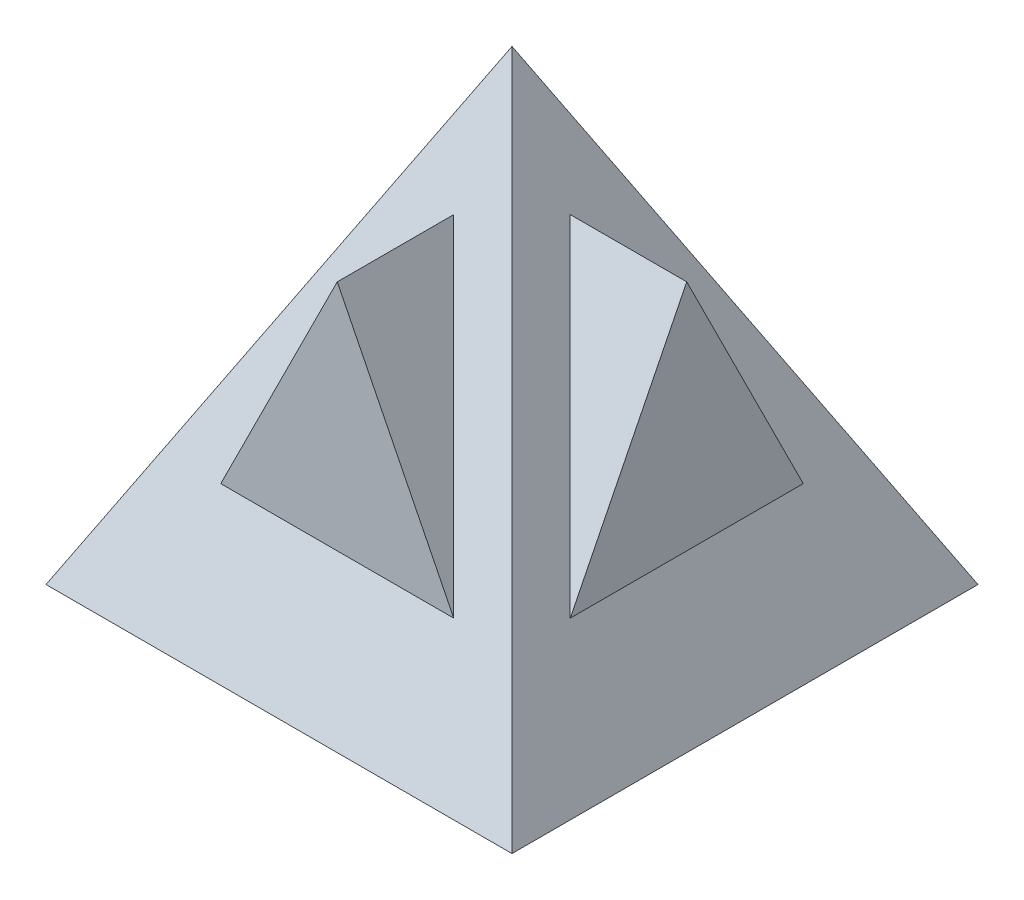
ISO-10303-21;
HEADER;
FILE_DESCRIPTION(('STEP AP214'),'2;1');
FILE_NAME('part.step','',(''),(''),'','','');
FILE_SCHEMA(('AUTOMOTIVE_DESIGN { 1 0 10303 214 1 1 1 1 }'));
ENDSEC;
DATA;
#1=APPLICATION_CONTEXT('core data for automotive mechanical design processes');
#2=APPLICATION_PROTOCOL_DEFINITION('international standard','automotive_design',2000,#1);
#3=PRODUCT_CONTEXT('',#1,'mechanical');
#4=PRODUCT('Part','Part','',(#3));
#5=PRODUCT_RELATED_PRODUCT_CATEGORY('part','',(#4));
#6=PRODUCT_DEFINITION_FORMATION('','',#4);
#7=PRODUCT_DEFINITION_CONTEXT('part definition',#1,'design');
#8=PRODUCT_DEFINITION('design','',#6,#7);
#9=PRODUCT_DEFINITION_SHAPE('','',#8);
#10=(LENGTH_UNIT() NAMED_UNIT(*) SI_UNIT(.MILLI.,.METRE.));
#11=(NAMED_UNIT(*) PLANE_ANGLE_UNIT() SI_UNIT($,.RADIAN.));
#12=(NAMED_UNIT(*) SI_UNIT($,.STERADIAN.) SOLID_ANGLE_UNIT());
#13=UNCERTAINTY_MEASURE_WITH_UNIT(LENGTH_MEASURE(1.E-05),#10,'distance_accuracy_value','');
#14=(GEOMETRIC_REPRESENTATION_CONTEXT(3) GLOBAL_UNCERTAINTY_ASSIGNED_CONTEXT((#13)) GLOBAL_UNIT_ASSIGNED_CONTEXT((#10,
#11,#12)) REPRESENTATION_CONTEXT('',''));
#15=CARTESIAN_POINT('',(0.,0.,0.));
#16=DIRECTION('',(0.,0.,1.));
#17=DIRECTION('',(1.,0.,0.));
#18=AXIS2_PLACEMENT_3D('',#15,#16,#17);
#19=CARTESIAN_POINT('',(0.,1.6,3.2));
#20=DIRECTION('',(0.,0.447213595499958,0.894427190999916));
#21=DIRECTION('',(0.,-0.894427190999916,0.447213595499958));
#22=AXIS2_PLACEMENT_3D('',#19,#20,#21);
#23=PLANE('',#22);
#24=DIRECTION('',(-0.408248290463863,-0.816496580927726,0.408248290463863));
#25=VECTOR('',#24,1.);
#26=CARTESIAN_POINT('',(0.,8.,0.));
#27=LINE('',#26,#25);
#28=CARTESIAN_POINT('',(0.,8.,0.));
#29=VERTEX_POINT('',#28);
#30=CARTESIAN_POINT('',(-4.,0.,4.));
#31=VERTEX_POINT('',#30);
#32=EDGE_CURVE('E136',#29,#31,#27,.T.);
#33=ORIENTED_EDGE('',*,*,#32,.T.);
#34=DIRECTION('',(1.,0.,0.));
#35=VECTOR('',#34,1.);
#36=CARTESIAN_POINT('',(-4.,0.,4.));
#37=LINE('',#36,#35);
#38=CARTESIAN_POINT('',(4.,0.,4.));
#39=VERTEX_POINT('',#38);
#40=EDGE_CURVE('E130',#31,#39,#37,.T.);
#41=ORIENTED_EDGE('',*,*,#40,.T.);
#42=DIRECTION('',(0.408248290463863,-0.816496580927726,0.408248290463863));
#43=VECTOR('',#42,1.);
#44=CARTESIAN_POINT('',(0.,8.,0.));
#45=LINE('',#44,#43);
#46=EDGE_CURVE('E317',#29,#39,#45,.T.);
#47=ORIENTED_EDGE('',*,*,#46,.F.);
#48=EDGE_LOOP('',(#33,#41,#47));
#49=FACE_BOUND('',#48,.T.);
#50=DIRECTION('',(0.408248290463863,0.816496580927726,-0.408248290463863));
#51=VECTOR('',#50,1.);
#52=CARTESIAN_POINT('',(-1.83333333333333,2.33333333333333,2.83333333333333));
#53=LINE('',#52,#51);
#54=CARTESIAN_POINT('',(-2.,2.,3.));
#55=VERTEX_POINT('',#54);
#56=CARTESIAN_POINT('',(0.,6.,1.));
#57=VERTEX_POINT('',#56);
#58=EDGE_CURVE('E50',#55,#57,#53,.T.);
#59=ORIENTED_EDGE('',*,*,#58,.T.);
#60=DIRECTION('',(0.408248290463863,-0.816496580927726,0.408248290463863));
#61=VECTOR('',#60,1.);
#62=CARTESIAN_POINT('',(1.83333333333333,2.33333333333333,2.83333333333333));
#63=LINE('',#62,#61);
#64=CARTESIAN_POINT('',(2.,2.,3.));
#65=VERTEX_POINT('',#64);
#66=EDGE_CURVE('E12',#57,#65,#63,.T.);
#67=ORIENTED_EDGE('',*,*,#66,.T.);
#68=DIRECTION('',(1.,0.,0.));
#69=VECTOR('',#68,1.);
#70=CARTESIAN_POINT('',(-2.,2.,3.));
#71=LINE('',#70,#69);
#72=EDGE_CURVE('E119',#55,#65,#71,.T.);
#73=ORIENTED_EDGE('',*,*,#72,.F.);
#74=EDGE_LOOP('',(#59,#67,#73));
#75=FACE_BOUND('',#74,.T.);
#76=ADVANCED_FACE('F41',(#49,#75),#23,.T.);
#77=CARTESIAN_POINT('',(3.2,1.6,0.));
#78=DIRECTION('',(0.894427190999916,0.447213595499958,0.));
#79=DIRECTION('',(-0.447213595499958,0.894427190999916,0.));
#80=AXIS2_PLACEMENT_3D('',#77,#78,#79);
#81=PLANE('',#80);
#82=ORIENTED_EDGE('',*,*,#46,.T.);
#83=DIRECTION('',(0.,0.,-1.));
#84=VECTOR('',#83,1.);
#85=CARTESIAN_POINT('',(4.,0.,4.));
#86=LINE('',#85,#84);
#87=CARTESIAN_POINT('',(4.,0.,-4.));
#88=VERTEX_POINT('',#87);
#89=EDGE_CURVE('E174',#39,#88,#86,.T.);
#90=ORIENTED_EDGE('',*,*,#89,.T.);
#91=DIRECTION('',(0.408248290463863,-0.816496580927726,-0.408248290463863));
#92=VECTOR('',#91,1.);
#93=CARTESIAN_POINT('',(0.,8.,0.));
#94=LINE('',#93,#92);
#95=EDGE_CURVE('E209',#29,#88,#94,.T.);
#96=ORIENTED_EDGE('',*,*,#95,.F.);
#97=EDGE_LOOP('',(#82,#90,#96));
#98=FACE_BOUND('',#97,.T.);
#99=DIRECTION('',(0.,0.,-1.));
#100=VECTOR('',#99,1.);
#101=CARTESIAN_POINT('',(3.00000000000001,2.,1.99999999999999));
#102=LINE('',#101,#100);
#103=CARTESIAN_POINT('',(3.00000000000001,1.99999999999999,1.99999999999999));
#104=VERTEX_POINT('',#103);
#105=CARTESIAN_POINT('',(2.99999999999999,2.,-2.00000000000001));
#106=VERTEX_POINT('',#105);
#107=EDGE_CURVE('E103',#104,#106,#102,.T.);
#108=ORIENTED_EDGE('',*,*,#107,.F.);
#109=DIRECTION('',(-0.408248290463863,0.816496580927727,-0.408248290463862));
#110=VECTOR('',#109,1.);
#111=CARTESIAN_POINT('',(2.83333333333334,2.33333333333333,1.83333333333333));
#112=LINE('',#111,#110);
#113=CARTESIAN_POINT('',(1.,6.,0.));
#114=VERTEX_POINT('',#113);
#115=EDGE_CURVE('E101',#104,#114,#112,.T.);
#116=ORIENTED_EDGE('',*,*,#115,.T.);
#117=DIRECTION('',(0.408248290463863,-0.816496580927725,-0.408248290463865));
#118=VECTOR('',#117,1.);
#119=CARTESIAN_POINT('',(2.83333333333333,2.33333333333334,-1.83333333333334));
#120=LINE('',#119,#118);
#121=EDGE_CURVE('E112',#114,#106,#120,.T.);
#122=ORIENTED_EDGE('',*,*,#121,.T.);
#123=EDGE_LOOP('',(#108,#116,#122));
#124=FACE_BOUND('',#123,.T.);
#125=ADVANCED_FACE('F147',(#98,#124),#81,.T.);
#126=CARTESIAN_POINT('',(0.,0.,0.));
#127=DIRECTION('',(0.,-1.,0.));
#128=DIRECTION('',(0.,0.,-1.));
#129=AXIS2_PLACEMENT_3D('',#126,#127,#128);
#130=PLANE('',#129);
#131=DIRECTION('',(0.,0.,1.));
#132=VECTOR('',#131,1.);
#133=CARTESIAN_POINT('',(-4.,0.,4.));
#134=LINE('',#133,#132);
#135=CARTESIAN_POINT('',(-4.,0.,-4.));
#136=VERTEX_POINT('',#135);
#137=EDGE_CURVE('E124',#136,#31,#134,.T.);
#138=ORIENTED_EDGE('',*,*,#137,.F.);
#139=DIRECTION('',(-1.,0.,0.));
#140=VECTOR('',#139,1.);
#141=CARTESIAN_POINT('',(-4.,0.,-4.));
#142=LINE('',#141,#140);
#143=EDGE_CURVE('E189',#88,#136,#142,.T.);
#144=ORIENTED_EDGE('',*,*,#143,.F.);
#145=ORIENTED_EDGE('',*,*,#89,.F.);
#146=ORIENTED_EDGE('',*,*,#40,.F.);
#147=EDGE_LOOP('',(#138,#144,#145,#146));
#148=FACE_BOUND('',#147,.T.);
#149=ADVANCED_FACE('F148',(#148),#130,.T.);
#150=CARTESIAN_POINT('',(-3.2,1.6,0.));
#151=DIRECTION('',(-0.894427190999916,0.447213595499958,0.));
#152=DIRECTION('',(-0.447213595499958,-0.894427190999916,0.));
#153=AXIS2_PLACEMENT_3D('',#150,#151,#152);
#154=PLANE('',#153);
#155=DIRECTION('',(-0.408248290463863,-0.816496580927726,-0.408248290463863));
#156=VECTOR('',#155,1.);
#157=CARTESIAN_POINT('',(0.,8.,0.));
#158=LINE('',#157,#156);
#159=EDGE_CURVE('E249',#29,#136,#158,.T.);
#160=ORIENTED_EDGE('',*,*,#159,.T.);
#161=ORIENTED_EDGE('',*,*,#137,.T.);
#162=ORIENTED_EDGE('',*,*,#32,.F.);
#163=EDGE_LOOP('',(#160,#161,#162));
#164=FACE_BOUND('',#163,.T.);
#165=ADVANCED_FACE('F154',(#164),#154,.T.);
#166=CARTESIAN_POINT('',(0.,1.6,-3.2));
#167=DIRECTION('',(0.,0.447213595499958,-0.894427190999916));
#168=DIRECTION('',(0.,0.894427190999916,0.447213595499958));
#169=AXIS2_PLACEMENT_3D('',#166,#167,#168);
#170=PLANE('',#169);
#171=ORIENTED_EDGE('',*,*,#95,.T.);
#172=ORIENTED_EDGE('',*,*,#143,.T.);
#173=ORIENTED_EDGE('',*,*,#159,.F.);
#174=EDGE_LOOP('',(#171,#172,#173));
#175=FACE_BOUND('',#174,.T.);
#176=ADVANCED_FACE('F43',(#175),#170,.T.);
#177=CARTESIAN_POINT('',(3.,0.,0.));
#178=DIRECTION('',(-1.,0.,0.));
#179=DIRECTION('',(0.,0.,1.));
#180=AXIS2_PLACEMENT_3D('',#177,#178,#179);
#181=PLANE('',#180);
#182=DIRECTION('',(0.,0.894427190999916,0.447213595499958));
#183=VECTOR('',#182,1.);
#184=CARTESIAN_POINT('',(2.99999999999999,2.,-2.00000000000001));
#185=LINE('',#184,#183);
#186=CARTESIAN_POINT('',(3.,6.,0.));
#187=VERTEX_POINT('',#186);
#188=EDGE_CURVE('E104',#106,#187,#185,.T.);
#189=ORIENTED_EDGE('',*,*,#188,.T.);
#190=DIRECTION('',(0.,-0.894427190999916,0.447213595499958));
#191=VECTOR('',#190,1.);
#192=CARTESIAN_POINT('',(3.,6.,0.));
#193=LINE('',#192,#191);
#194=EDGE_CURVE('E65',#187,#104,#193,.T.);
#195=ORIENTED_EDGE('',*,*,#194,.T.);
#196=ORIENTED_EDGE('',*,*,#107,.T.);
#197=EDGE_LOOP('',(#189,#195,#196));
#198=FACE_BOUND('',#197,.T.);
#199=ADVANCED_FACE('F107',(#198),#181,.F.);
#200=CARTESIAN_POINT('',(2.99999999999999,2.,-2.00000000000001));
#201=DIRECTION('',(0.,-0.447213595499958,0.894427190999916));
#202=DIRECTION('',(0.,-0.894427190999916,-0.447213595499958));
#203=AXIS2_PLACEMENT_3D('',#200,#201,#202);
#204=PLANE('',#203);
#205=ORIENTED_EDGE('',*,*,#121,.F.);
#206=DIRECTION('',(-1.,0.,0.));
#207=VECTOR('',#206,1.);
#208=CARTESIAN_POINT('',(3.,6.,0.));
#209=LINE('',#208,#207);
#210=EDGE_CURVE('E99',#187,#114,#209,.T.);
#211=ORIENTED_EDGE('',*,*,#210,.F.);
#212=ORIENTED_EDGE('',*,*,#188,.F.);
#213=EDGE_LOOP('',(#205,#211,#212));
#214=FACE_BOUND('',#213,.T.);
#215=ADVANCED_FACE('F111',(#214),#204,.F.);
#216=CARTESIAN_POINT('',(3.,6.,0.));
#217=DIRECTION('',(0.,-0.447213595499958,-0.894427190999916));
#218=DIRECTION('',(0.,0.894427190999916,-0.447213595499958));
#219=AXIS2_PLACEMENT_3D('',#216,#217,#218);
#220=PLANE('',#219);
#221=ORIENTED_EDGE('',*,*,#115,.F.);
#222=ORIENTED_EDGE('',*,*,#194,.F.);
#223=ORIENTED_EDGE('',*,*,#210,.T.);
#224=EDGE_LOOP('',(#221,#222,#223));
#225=FACE_BOUND('',#224,.T.);
#226=ADVANCED_FACE('F97',(#225),#220,.F.);
#227=CARTESIAN_POINT('',(2.,2.,3.));
#228=DIRECTION('',(-0.894427190999916,-0.447213595499958,0.));
#229=DIRECTION('',(0.447213595499958,-0.894427190999916,0.));
#230=AXIS2_PLACEMENT_3D('',#227,#228,#229);
#231=PLANE('',#230);
#232=ORIENTED_EDGE('',*,*,#66,.F.);
#233=DIRECTION('',(0.,0.,-1.));
#234=VECTOR('',#233,1.);
#235=CARTESIAN_POINT('',(0.,6.,3.));
#236=LINE('',#235,#234);
#237=CARTESIAN_POINT('',(0.,6.,3.));
#238=VERTEX_POINT('',#237);
#239=EDGE_CURVE('E121',#238,#57,#236,.T.);
#240=ORIENTED_EDGE('',*,*,#239,.F.);
#241=DIRECTION('',(-0.447213595499958,0.894427190999916,0.));
#242=VECTOR('',#241,1.);
#243=CARTESIAN_POINT('',(2.,2.,3.));
#244=LINE('',#243,#242);
#245=EDGE_CURVE('E113',#65,#238,#244,.T.);
#246=ORIENTED_EDGE('',*,*,#245,.F.);
#247=EDGE_LOOP('',(#232,#240,#246));
#248=FACE_BOUND('',#247,.T.);
#249=ADVANCED_FACE('F218',(#248),#231,.F.);
#250=CARTESIAN_POINT('',(0.,6.,3.));
#251=DIRECTION('',(0.894427190999916,-0.447213595499958,0.));
#252=DIRECTION('',(0.447213595499958,0.894427190999916,0.));
#253=AXIS2_PLACEMENT_3D('',#250,#251,#252);
#254=PLANE('',#253);
#255=ORIENTED_EDGE('',*,*,#58,.F.);
#256=DIRECTION('',(-0.447213595499958,-0.894427190999916,0.));
#257=VECTOR('',#256,1.);
#258=CARTESIAN_POINT('',(0.,6.,3.));
#259=LINE('',#258,#257);
#260=EDGE_CURVE('E57',#238,#55,#259,.T.);
#261=ORIENTED_EDGE('',*,*,#260,.F.);
#262=ORIENTED_EDGE('',*,*,#239,.T.);
#263=EDGE_LOOP('',(#255,#261,#262));
#264=FACE_BOUND('',#263,.T.);
#265=ADVANCED_FACE('F214',(#264),#254,.F.);
#266=CARTESIAN_POINT('',(0.,0.,3.));
#267=DIRECTION('',(0.,0.,-1.));
#268=DIRECTION('',(-1.,0.,0.));
#269=AXIS2_PLACEMENT_3D('',#266,#267,#268);
#270=PLANE('',#269);
#271=ORIENTED_EDGE('',*,*,#245,.T.);
#272=ORIENTED_EDGE('',*,*,#260,.T.);
#273=ORIENTED_EDGE('',*,*,#72,.T.);
#274=EDGE_LOOP('',(#271,#272,#273));
#275=FACE_BOUND('',#274,.T.);
#276=ADVANCED_FACE('F219',(#275),#270,.F.);
#277=CLOSED_SHELL('',(#76,#125,#149,#165,#176,#199,#215,#226,#249,#265,#276));
#278=MANIFOLD_SOLID_BREP('B2',#277);
#279=ADVANCED_BREP_SHAPE_REPRESENTATION('',(#18,#278),#14);
#280=SHAPE_DEFINITION_REPRESENTATION(#9,#279);
ENDSEC;
END-ISO-10303-21;
